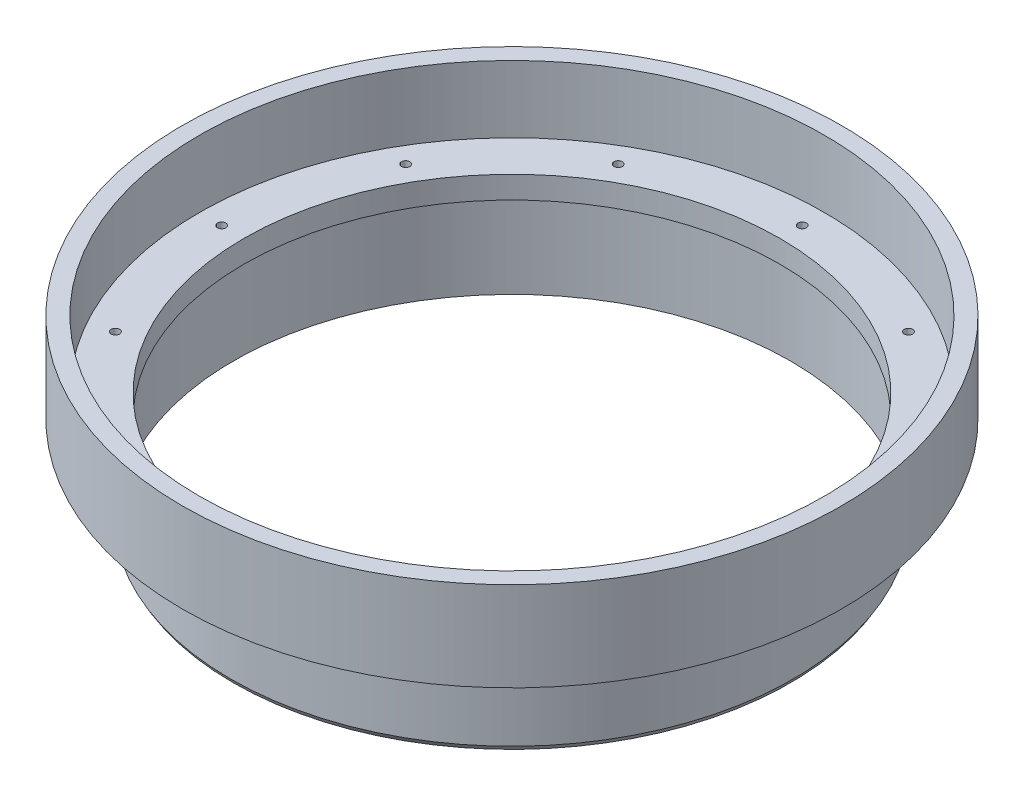
ISO-10303-21;
HEADER;
FILE_DESCRIPTION(('STEP AP214'),'2;1');
FILE_NAME('part.step','',(''),(''),'','','');
FILE_SCHEMA(('AUTOMOTIVE_DESIGN { 1 0 10303 214 1 1 1 1 }'));
ENDSEC;
DATA;
#1=APPLICATION_CONTEXT('core data for automotive mechanical design processes');
#2=APPLICATION_PROTOCOL_DEFINITION('international standard','automotive_design',2000,#1);
#3=PRODUCT_CONTEXT('',#1,'mechanical');
#4=PRODUCT('Part','Part','',(#3));
#5=PRODUCT_RELATED_PRODUCT_CATEGORY('part','',(#4));
#6=PRODUCT_DEFINITION_FORMATION('','',#4);
#7=PRODUCT_DEFINITION_CONTEXT('part definition',#1,'design');
#8=PRODUCT_DEFINITION('design','',#6,#7);
#9=PRODUCT_DEFINITION_SHAPE('','',#8);
#10=(LENGTH_UNIT() NAMED_UNIT(*) SI_UNIT(.MILLI.,.METRE.));
#11=(NAMED_UNIT(*) PLANE_ANGLE_UNIT() SI_UNIT($,.RADIAN.));
#12=(NAMED_UNIT(*) SI_UNIT($,.STERADIAN.) SOLID_ANGLE_UNIT());
#13=UNCERTAINTY_MEASURE_WITH_UNIT(LENGTH_MEASURE(1.E-05),#10,'distance_accuracy_value','');
#14=(GEOMETRIC_REPRESENTATION_CONTEXT(3) GLOBAL_UNCERTAINTY_ASSIGNED_CONTEXT((#13)) GLOBAL_UNIT_ASSIGNED_CONTEXT((#10,
#11,#12)) REPRESENTATION_CONTEXT('',''));
#15=CARTESIAN_POINT('',(0.,0.,0.));
#16=DIRECTION('',(0.,0.,1.));
#17=DIRECTION('',(1.,0.,0.));
#18=AXIS2_PLACEMENT_3D('',#15,#16,#17);
#19=CARTESIAN_POINT('',(-44.45,0.,0.));
#20=DIRECTION('',(0.,1.,0.));
#21=DIRECTION('',(0.,0.,1.));
#22=AXIS2_PLACEMENT_3D('',#19,#20,#21);
#23=PLANE('',#22);
#24=CARTESIAN_POINT('',(-35.7451985412029,0.,20.6374999999996));
#25=DIRECTION('',(0.,1.,0.));
#26=DIRECTION('',(0.,0.,1.));
#27=AXIS2_PLACEMENT_3D('',#24,#25,#26);
#28=CIRCLE('',#27,0.59563);
#29=CARTESIAN_POINT('',(-35.7451985412029,0.,21.2331299999996));
#30=VERTEX_POINT('',#29);
#31=EDGE_CURVE('E141',#30,#30,#28,.T.);
#32=ORIENTED_EDGE('',*,*,#31,.F.);
#33=EDGE_LOOP('',(#32));
#34=FACE_BOUND('',#33,.T.);
#35=CARTESIAN_POINT('',(-20.6375000000004,0.,35.7451985412025));
#36=DIRECTION('',(0.,1.,0.));
#37=DIRECTION('',(0.,0.,1.));
#38=AXIS2_PLACEMENT_3D('',#35,#36,#37);
#39=CIRCLE('',#38,0.59563);
#40=CARTESIAN_POINT('',(-20.6375000000004,0.,36.3408285412025));
#41=VERTEX_POINT('',#40);
#42=EDGE_CURVE('E135',#41,#41,#39,.T.);
#43=ORIENTED_EDGE('',*,*,#42,.F.);
#44=EDGE_LOOP('',(#43));
#45=FACE_BOUND('',#44,.T.);
#46=CARTESIAN_POINT('',(-3.53958818572525E-13,0.,41.275));
#47=DIRECTION('',(0.,1.,0.));
#48=DIRECTION('',(0.,0.,1.));
#49=AXIS2_PLACEMENT_3D('',#46,#47,#48);
#50=CIRCLE('',#49,0.595629999999999);
#51=CARTESIAN_POINT('',(-3.53958818572525E-13,0.,41.87063));
#52=VERTEX_POINT('',#51);
#53=EDGE_CURVE('E129',#52,#52,#50,.T.);
#54=ORIENTED_EDGE('',*,*,#53,.F.);
#55=EDGE_LOOP('',(#54));
#56=FACE_BOUND('',#55,.T.);
#57=CARTESIAN_POINT('',(20.6374999999997,0.,35.7451985412029));
#58=DIRECTION('',(0.,1.,0.));
#59=DIRECTION('',(0.,0.,1.));
#60=AXIS2_PLACEMENT_3D('',#57,#58,#59);
#61=CIRCLE('',#60,0.59563);
#62=CARTESIAN_POINT('',(20.6374999999997,0.,36.3408285412029));
#63=VERTEX_POINT('',#62);
#64=EDGE_CURVE('E123',#63,#63,#61,.T.);
#65=ORIENTED_EDGE('',*,*,#64,.F.);
#66=EDGE_LOOP('',(#65));
#67=FACE_BOUND('',#66,.T.);
#68=CARTESIAN_POINT('',(35.7451985412026,0.,20.6375000000002));
#69=DIRECTION('',(0.,1.,0.));
#70=DIRECTION('',(0.,0.,1.));
#71=AXIS2_PLACEMENT_3D('',#68,#69,#70);
#72=CIRCLE('',#71,0.59563);
#73=CARTESIAN_POINT('',(35.7451985412026,0.,21.2331300000002));
#74=VERTEX_POINT('',#73);
#75=EDGE_CURVE('E117',#74,#74,#72,.T.);
#76=ORIENTED_EDGE('',*,*,#75,.F.);
#77=EDGE_LOOP('',(#76));
#78=FACE_BOUND('',#77,.T.);
#79=CARTESIAN_POINT('',(41.275,0.,2.28177708448336E-13));
#80=DIRECTION('',(0.,1.,0.));
#81=DIRECTION('',(0.,0.,1.));
#82=AXIS2_PLACEMENT_3D('',#79,#80,#81);
#83=CIRCLE('',#82,0.59563);
#84=CARTESIAN_POINT('',(41.275,0.,0.595630000000228));
#85=VERTEX_POINT('',#84);
#86=EDGE_CURVE('E111',#85,#85,#83,.T.);
#87=ORIENTED_EDGE('',*,*,#86,.F.);
#88=EDGE_LOOP('',(#87));
#89=FACE_BOUND('',#88,.T.);
#90=CARTESIAN_POINT('',(35.7451985412028,0.,-20.6374999999998));
#91=DIRECTION('',(0.,1.,0.));
#92=DIRECTION('',(0.,0.,1.));
#93=AXIS2_PLACEMENT_3D('',#90,#91,#92);
#94=CIRCLE('',#93,0.59563);
#95=CARTESIAN_POINT('',(35.7451985412028,0.,-20.0418699999998));
#96=VERTEX_POINT('',#95);
#97=EDGE_CURVE('E105',#96,#96,#94,.T.);
#98=ORIENTED_EDGE('',*,*,#97,.F.);
#99=EDGE_LOOP('',(#98));
#100=FACE_BOUND('',#99,.T.);
#101=CARTESIAN_POINT('',(20.6375000000001,0.,-35.7451985412026));
#102=DIRECTION('',(0.,1.,0.));
#103=DIRECTION('',(0.,0.,1.));
#104=AXIS2_PLACEMENT_3D('',#101,#102,#103);
#105=CIRCLE('',#104,0.59563);
#106=CARTESIAN_POINT('',(20.6375000000001,0.,-35.1495685412026));
#107=VERTEX_POINT('',#106);
#108=EDGE_CURVE('E99',#107,#107,#105,.T.);
#109=ORIENTED_EDGE('',*,*,#108,.F.);
#110=EDGE_LOOP('',(#109));
#111=FACE_BOUND('',#110,.T.);
#112=CARTESIAN_POINT('',(1.11561489392428E-13,0.,-41.275));
#113=DIRECTION('',(0.,1.,0.));
#114=DIRECTION('',(0.,0.,1.));
#115=AXIS2_PLACEMENT_3D('',#112,#113,#114);
#116=CIRCLE('',#115,0.595629999999999);
#117=CARTESIAN_POINT('',(1.11561489392428E-13,0.,-40.67937));
#118=VERTEX_POINT('',#117);
#119=EDGE_CURVE('E93',#118,#118,#116,.T.);
#120=ORIENTED_EDGE('',*,*,#119,.F.);
#121=EDGE_LOOP('',(#120));
#122=FACE_BOUND('',#121,.T.);
#123=CARTESIAN_POINT('',(-20.6374999999999,0.,-35.7451985412027));
#124=DIRECTION('',(0.,1.,0.));
#125=DIRECTION('',(0.,0.,1.));
#126=AXIS2_PLACEMENT_3D('',#123,#124,#125);
#127=CIRCLE('',#126,0.59563);
#128=CARTESIAN_POINT('',(-20.6374999999999,0.,-35.1495685412027));
#129=VERTEX_POINT('',#128);
#130=EDGE_CURVE('E87',#129,#129,#127,.T.);
#131=ORIENTED_EDGE('',*,*,#130,.F.);
#132=EDGE_LOOP('',(#131));
#133=FACE_BOUND('',#132,.T.);
#134=CARTESIAN_POINT('',(-35.7451985412027,0.,-20.6375));
#135=DIRECTION('',(0.,1.,0.));
#136=DIRECTION('',(0.,0.,1.));
#137=AXIS2_PLACEMENT_3D('',#134,#135,#136);
#138=CIRCLE('',#137,0.59563);
#139=CARTESIAN_POINT('',(-35.7451985412027,0.,-20.04187));
#140=VERTEX_POINT('',#139);
#141=EDGE_CURVE('E81',#140,#140,#138,.T.);
#142=ORIENTED_EDGE('',*,*,#141,.F.);
#143=EDGE_LOOP('',(#142));
#144=FACE_BOUND('',#143,.T.);
#145=CARTESIAN_POINT('',(-41.275,0.,0.));
#146=DIRECTION('',(0.,1.,0.));
#147=DIRECTION('',(0.,0.,1.));
#148=AXIS2_PLACEMENT_3D('',#145,#146,#147);
#149=CIRCLE('',#148,0.59563);
#150=CARTESIAN_POINT('',(-41.275,0.,0.595630000000005));
#151=VERTEX_POINT('',#150);
#152=EDGE_CURVE('E75',#151,#151,#149,.T.);
#153=ORIENTED_EDGE('',*,*,#152,.F.);
#154=EDGE_LOOP('',(#153));
#155=FACE_BOUND('',#154,.T.);
#156=CARTESIAN_POINT('',(0.,0.,0.));
#157=DIRECTION('',(0.,1.,0.));
#158=DIRECTION('',(0.,0.,1.));
#159=AXIS2_PLACEMENT_3D('',#156,#157,#158);
#160=CIRCLE('',#159,44.45);
#161=CARTESIAN_POINT('',(0.,0.,44.45));
#162=VERTEX_POINT('',#161);
#163=EDGE_CURVE('E69',#162,#162,#160,.T.);
#164=ORIENTED_EDGE('',*,*,#163,.T.);
#165=EDGE_LOOP('',(#164));
#166=FACE_BOUND('',#165,.T.);
#167=CARTESIAN_POINT('',(0.,0.,0.));
#168=DIRECTION('',(0.,1.,0.));
#169=DIRECTION('',(0.,0.,1.));
#170=AXIS2_PLACEMENT_3D('',#167,#168,#169);
#171=CIRCLE('',#170,38.1);
#172=CARTESIAN_POINT('',(0.,0.,38.1));
#173=VERTEX_POINT('',#172);
#174=EDGE_CURVE('E10',#173,#173,#171,.T.);
#175=ORIENTED_EDGE('',*,*,#174,.F.);
#176=EDGE_LOOP('',(#175));
#177=FACE_BOUND('',#176,.T.);
#178=ADVANCED_FACE('F35',(#34,#45,#56,#67,#78,#89,#100,#111,#122,#133,#144,#155,#166,#177),#23,.T.);
#179=CARTESIAN_POINT('',(0.,55.,0.));
#180=DIRECTION('',(0.,1.,0.));
#181=DIRECTION('',(0.,0.,1.));
#182=AXIS2_PLACEMENT_3D('',#179,#180,#181);
#183=CYLINDRICAL_SURFACE('',#182,38.1);
#184=ORIENTED_EDGE('',*,*,#174,.T.);
#185=EDGE_LOOP('',(#184));
#186=FACE_BOUND('',#185,.T.);
#187=CARTESIAN_POINT('',(0.,-3.175,0.));
#188=DIRECTION('',(0.,1.,0.));
#189=DIRECTION('',(0.,0.,1.));
#190=AXIS2_PLACEMENT_3D('',#187,#188,#189);
#191=CIRCLE('',#190,38.1);
#192=CARTESIAN_POINT('',(0.,-3.175,38.1));
#193=VERTEX_POINT('',#192);
#194=EDGE_CURVE('E41',#193,#193,#191,.T.);
#195=ORIENTED_EDGE('',*,*,#194,.F.);
#196=EDGE_LOOP('',(#195));
#197=FACE_BOUND('',#196,.T.);
#198=ADVANCED_FACE('F149',(#186,#197),#183,.F.);
#199=CARTESIAN_POINT('',(-38.1,-3.175,0.));
#200=DIRECTION('',(0.,-1.,0.));
#201=DIRECTION('',(0.,0.,-1.));
#202=AXIS2_PLACEMENT_3D('',#199,#200,#201);
#203=PLANE('',#202);
#204=ORIENTED_EDGE('',*,*,#194,.T.);
#205=EDGE_LOOP('',(#204));
#206=FACE_BOUND('',#205,.T.);
#207=CARTESIAN_POINT('',(0.,-3.175,0.));
#208=DIRECTION('',(0.,1.,0.));
#209=DIRECTION('',(0.,0.,1.));
#210=AXIS2_PLACEMENT_3D('',#207,#208,#209);
#211=CIRCLE('',#210,39.624);
#212=CARTESIAN_POINT('',(0.,-3.175,39.624));
#213=VERTEX_POINT('',#212);
#214=EDGE_CURVE('E45',#213,#213,#211,.T.);
#215=ORIENTED_EDGE('',*,*,#214,.F.);
#216=EDGE_LOOP('',(#215));
#217=FACE_BOUND('',#216,.T.);
#218=ADVANCED_FACE('F211',(#206,#217),#203,.T.);
#219=CARTESIAN_POINT('',(0.,55.,0.));
#220=DIRECTION('',(0.,1.,0.));
#221=DIRECTION('',(0.,0.,1.));
#222=AXIS2_PLACEMENT_3D('',#219,#220,#221);
#223=CYLINDRICAL_SURFACE('',#222,39.624);
#224=ORIENTED_EDGE('',*,*,#214,.T.);
#225=EDGE_LOOP('',(#224));
#226=FACE_BOUND('',#225,.T.);
#227=CARTESIAN_POINT('',(0.,-15.875,0.));
#228=DIRECTION('',(0.,1.,0.));
#229=DIRECTION('',(0.,0.,1.));
#230=AXIS2_PLACEMENT_3D('',#227,#228,#229);
#231=CIRCLE('',#230,39.624);
#232=CARTESIAN_POINT('',(0.,-15.875,39.624));
#233=VERTEX_POINT('',#232);
#234=EDGE_CURVE('E49',#233,#233,#231,.T.);
#235=ORIENTED_EDGE('',*,*,#234,.F.);
#236=EDGE_LOOP('',(#235));
#237=FACE_BOUND('',#236,.T.);
#238=ADVANCED_FACE('F207',(#226,#237),#223,.F.);
#239=CARTESIAN_POINT('',(0.,-15.2150886423163,0.));
#240=DIRECTION('',(0.,1.,0.));
#241=DIRECTION('',(0.,0.,1.));
#242=AXIS2_PLACEMENT_3D('',#239,#240,#241);
#243=CONICAL_SURFACE('',#242,40.005,0.523598775598298);
#244=ORIENTED_EDGE('',*,*,#234,.T.);
#245=EDGE_LOOP('',(#244));
#246=FACE_BOUND('',#245,.T.);
#247=CARTESIAN_POINT('',(0.,-15.2150886423163,0.));
#248=DIRECTION('',(0.,1.,0.));
#249=DIRECTION('',(0.,0.,1.));
#250=AXIS2_PLACEMENT_3D('',#247,#248,#249);
#251=CIRCLE('',#250,40.005);
#252=CARTESIAN_POINT('',(0.,-15.2150886423163,40.005));
#253=VERTEX_POINT('',#252);
#254=EDGE_CURVE('E54',#253,#253,#251,.T.);
#255=ORIENTED_EDGE('',*,*,#254,.F.);
#256=EDGE_LOOP('',(#255));
#257=FACE_BOUND('',#256,.T.);
#258=ADVANCED_FACE('F203',(#246,#257),#243,.T.);
#259=CARTESIAN_POINT('',(0.,55.,0.));
#260=DIRECTION('',(0.,1.,0.));
#261=DIRECTION('',(0.,0.,1.));
#262=AXIS2_PLACEMENT_3D('',#259,#260,#261);
#263=CYLINDRICAL_SURFACE('',#262,40.005);
#264=ORIENTED_EDGE('',*,*,#254,.T.);
#265=EDGE_LOOP('',(#264));
#266=FACE_BOUND('',#265,.T.);
#267=CARTESIAN_POINT('',(0.,-3.175,0.));
#268=DIRECTION('',(0.,1.,0.));
#269=DIRECTION('',(0.,0.,1.));
#270=AXIS2_PLACEMENT_3D('',#267,#268,#269);
#271=CIRCLE('',#270,40.005);
#272=CARTESIAN_POINT('',(0.,-3.175,40.005));
#273=VERTEX_POINT('',#272);
#274=EDGE_CURVE('E57',#273,#273,#271,.T.);
#275=ORIENTED_EDGE('',*,*,#274,.F.);
#276=EDGE_LOOP('',(#275));
#277=FACE_BOUND('',#276,.T.);
#278=ADVANCED_FACE('F199',(#266,#277),#263,.T.);
#279=CARTESIAN_POINT('',(-40.005,-3.175,0.));
#280=DIRECTION('',(0.,-1.,0.));
#281=DIRECTION('',(0.,0.,-1.));
#282=AXIS2_PLACEMENT_3D('',#279,#280,#281);
#283=PLANE('',#282);
#284=CARTESIAN_POINT('',(-35.7451985412029,-3.175,20.6374999999996));
#285=DIRECTION('',(0.,1.,0.));
#286=DIRECTION('',(0.,0.,1.));
#287=AXIS2_PLACEMENT_3D('',#284,#285,#286);
#288=CIRCLE('',#287,0.59563);
#289=CARTESIAN_POINT('',(-35.7451985412029,-3.175,21.2331299999996));
#290=VERTEX_POINT('',#289);
#291=EDGE_CURVE('E138',#290,#290,#288,.T.);
#292=ORIENTED_EDGE('',*,*,#291,.T.);
#293=EDGE_LOOP('',(#292));
#294=FACE_BOUND('',#293,.T.);
#295=CARTESIAN_POINT('',(-20.6375000000004,-3.175,35.7451985412025));
#296=DIRECTION('',(0.,1.,0.));
#297=DIRECTION('',(0.,0.,1.));
#298=AXIS2_PLACEMENT_3D('',#295,#296,#297);
#299=CIRCLE('',#298,0.59563);
#300=CARTESIAN_POINT('',(-20.6375000000004,-3.175,36.3408285412025));
#301=VERTEX_POINT('',#300);
#302=EDGE_CURVE('E132',#301,#301,#299,.T.);
#303=ORIENTED_EDGE('',*,*,#302,.T.);
#304=EDGE_LOOP('',(#303));
#305=FACE_BOUND('',#304,.T.);
#306=CARTESIAN_POINT('',(-3.53958818572525E-13,-3.175,41.275));
#307=DIRECTION('',(0.,1.,0.));
#308=DIRECTION('',(0.,0.,1.));
#309=AXIS2_PLACEMENT_3D('',#306,#307,#308);
#310=CIRCLE('',#309,0.595629999999999);
#311=CARTESIAN_POINT('',(-3.53958818572525E-13,-3.175,41.87063));
#312=VERTEX_POINT('',#311);
#313=EDGE_CURVE('E126',#312,#312,#310,.T.);
#314=ORIENTED_EDGE('',*,*,#313,.T.);
#315=EDGE_LOOP('',(#314));
#316=FACE_BOUND('',#315,.T.);
#317=CARTESIAN_POINT('',(20.6374999999997,-3.175,35.7451985412029));
#318=DIRECTION('',(0.,1.,0.));
#319=DIRECTION('',(0.,0.,1.));
#320=AXIS2_PLACEMENT_3D('',#317,#318,#319);
#321=CIRCLE('',#320,0.59563);
#322=CARTESIAN_POINT('',(20.6374999999997,-3.175,36.3408285412029));
#323=VERTEX_POINT('',#322);
#324=EDGE_CURVE('E120',#323,#323,#321,.T.);
#325=ORIENTED_EDGE('',*,*,#324,.T.);
#326=EDGE_LOOP('',(#325));
#327=FACE_BOUND('',#326,.T.);
#328=CARTESIAN_POINT('',(35.7451985412026,-3.175,20.6375000000002));
#329=DIRECTION('',(0.,1.,0.));
#330=DIRECTION('',(0.,0.,1.));
#331=AXIS2_PLACEMENT_3D('',#328,#329,#330);
#332=CIRCLE('',#331,0.59563);
#333=CARTESIAN_POINT('',(35.7451985412026,-3.175,21.2331300000002));
#334=VERTEX_POINT('',#333);
#335=EDGE_CURVE('E114',#334,#334,#332,.T.);
#336=ORIENTED_EDGE('',*,*,#335,.T.);
#337=EDGE_LOOP('',(#336));
#338=FACE_BOUND('',#337,.T.);
#339=CARTESIAN_POINT('',(41.275,-3.175,2.28177708448336E-13));
#340=DIRECTION('',(0.,1.,0.));
#341=DIRECTION('',(0.,0.,1.));
#342=AXIS2_PLACEMENT_3D('',#339,#340,#341);
#343=CIRCLE('',#342,0.59563);
#344=CARTESIAN_POINT('',(41.275,-3.175,0.595630000000228));
#345=VERTEX_POINT('',#344);
#346=EDGE_CURVE('E108',#345,#345,#343,.T.);
#347=ORIENTED_EDGE('',*,*,#346,.T.);
#348=EDGE_LOOP('',(#347));
#349=FACE_BOUND('',#348,.T.);
#350=CARTESIAN_POINT('',(35.7451985412028,-3.175,-20.6374999999998));
#351=DIRECTION('',(0.,1.,0.));
#352=DIRECTION('',(0.,0.,1.));
#353=AXIS2_PLACEMENT_3D('',#350,#351,#352);
#354=CIRCLE('',#353,0.59563);
#355=CARTESIAN_POINT('',(35.7451985412028,-3.175,-20.0418699999998));
#356=VERTEX_POINT('',#355);
#357=EDGE_CURVE('E102',#356,#356,#354,.T.);
#358=ORIENTED_EDGE('',*,*,#357,.T.);
#359=EDGE_LOOP('',(#358));
#360=FACE_BOUND('',#359,.T.);
#361=CARTESIAN_POINT('',(20.6375000000001,-3.175,-35.7451985412026));
#362=DIRECTION('',(0.,1.,0.));
#363=DIRECTION('',(0.,0.,1.));
#364=AXIS2_PLACEMENT_3D('',#361,#362,#363);
#365=CIRCLE('',#364,0.59563);
#366=CARTESIAN_POINT('',(20.6375000000001,-3.175,-35.1495685412026));
#367=VERTEX_POINT('',#366);
#368=EDGE_CURVE('E96',#367,#367,#365,.T.);
#369=ORIENTED_EDGE('',*,*,#368,.T.);
#370=EDGE_LOOP('',(#369));
#371=FACE_BOUND('',#370,.T.);
#372=CARTESIAN_POINT('',(1.11561489392428E-13,-3.175,-41.275));
#373=DIRECTION('',(0.,1.,0.));
#374=DIRECTION('',(0.,0.,1.));
#375=AXIS2_PLACEMENT_3D('',#372,#373,#374);
#376=CIRCLE('',#375,0.595629999999999);
#377=CARTESIAN_POINT('',(1.11561489392428E-13,-3.175,-40.67937));
#378=VERTEX_POINT('',#377);
#379=EDGE_CURVE('E90',#378,#378,#376,.T.);
#380=ORIENTED_EDGE('',*,*,#379,.T.);
#381=EDGE_LOOP('',(#380));
#382=FACE_BOUND('',#381,.T.);
#383=CARTESIAN_POINT('',(-20.6374999999999,-3.175,-35.7451985412027));
#384=DIRECTION('',(0.,1.,0.));
#385=DIRECTION('',(0.,0.,1.));
#386=AXIS2_PLACEMENT_3D('',#383,#384,#385);
#387=CIRCLE('',#386,0.59563);
#388=CARTESIAN_POINT('',(-20.6374999999999,-3.175,-35.1495685412027));
#389=VERTEX_POINT('',#388);
#390=EDGE_CURVE('E84',#389,#389,#387,.T.);
#391=ORIENTED_EDGE('',*,*,#390,.T.);
#392=EDGE_LOOP('',(#391));
#393=FACE_BOUND('',#392,.T.);
#394=CARTESIAN_POINT('',(-35.7451985412027,-3.175,-20.6375));
#395=DIRECTION('',(0.,1.,0.));
#396=DIRECTION('',(0.,0.,1.));
#397=AXIS2_PLACEMENT_3D('',#394,#395,#396);
#398=CIRCLE('',#397,0.59563);
#399=CARTESIAN_POINT('',(-35.7451985412027,-3.175,-20.04187));
#400=VERTEX_POINT('',#399);
#401=EDGE_CURVE('E78',#400,#400,#398,.T.);
#402=ORIENTED_EDGE('',*,*,#401,.T.);
#403=EDGE_LOOP('',(#402));
#404=FACE_BOUND('',#403,.T.);
#405=CARTESIAN_POINT('',(-41.275,-3.175,0.));
#406=DIRECTION('',(0.,1.,0.));
#407=DIRECTION('',(0.,0.,1.));
#408=AXIS2_PLACEMENT_3D('',#405,#406,#407);
#409=CIRCLE('',#408,0.59563);
#410=CARTESIAN_POINT('',(-41.275,-3.175,0.595630000000005));
#411=VERTEX_POINT('',#410);
#412=EDGE_CURVE('E72',#411,#411,#409,.T.);
#413=ORIENTED_EDGE('',*,*,#412,.T.);
#414=EDGE_LOOP('',(#413));
#415=FACE_BOUND('',#414,.T.);
#416=ORIENTED_EDGE('',*,*,#274,.T.);
#417=EDGE_LOOP('',(#416));
#418=FACE_BOUND('',#417,.T.);
#419=CARTESIAN_POINT('',(0.,-3.175,0.));
#420=DIRECTION('',(0.,1.,0.));
#421=DIRECTION('',(0.,0.,1.));
#422=AXIS2_PLACEMENT_3D('',#419,#420,#421);
#423=CIRCLE('',#422,46.863);
#424=CARTESIAN_POINT('',(0.,-3.175,46.863));
#425=VERTEX_POINT('',#424);
#426=EDGE_CURVE('E60',#425,#425,#423,.T.);
#427=ORIENTED_EDGE('',*,*,#426,.F.);
#428=EDGE_LOOP('',(#427));
#429=FACE_BOUND('',#428,.T.);
#430=ADVANCED_FACE('F195',(#294,#305,#316,#327,#338,#349,#360,#371,#382,#393,#404,#415,#418,
#429),#283,.T.);
#431=CARTESIAN_POINT('',(0.,55.,0.));
#432=DIRECTION('',(0.,1.,0.));
#433=DIRECTION('',(0.,0.,1.));
#434=AXIS2_PLACEMENT_3D('',#431,#432,#433);
#435=CYLINDRICAL_SURFACE('',#434,46.863);
#436=ORIENTED_EDGE('',*,*,#426,.T.);
#437=EDGE_LOOP('',(#436));
#438=FACE_BOUND('',#437,.T.);
#439=CARTESIAN_POINT('',(0.,9.525,0.));
#440=DIRECTION('',(0.,1.,0.));
#441=DIRECTION('',(0.,0.,1.));
#442=AXIS2_PLACEMENT_3D('',#439,#440,#441);
#443=CIRCLE('',#442,46.863);
#444=CARTESIAN_POINT('',(0.,9.525,46.863));
#445=VERTEX_POINT('',#444);
#446=EDGE_CURVE('E63',#445,#445,#443,.T.);
#447=ORIENTED_EDGE('',*,*,#446,.F.);
#448=EDGE_LOOP('',(#447));
#449=FACE_BOUND('',#448,.T.);
#450=ADVANCED_FACE('F188',(#438,#449),#435,.T.);
#451=CARTESIAN_POINT('',(-46.863,9.525,0.));
#452=DIRECTION('',(0.,1.,0.));
#453=DIRECTION('',(0.,0.,1.));
#454=AXIS2_PLACEMENT_3D('',#451,#452,#453);
#455=PLANE('',#454);
#456=ORIENTED_EDGE('',*,*,#446,.T.);
#457=EDGE_LOOP('',(#456));
#458=FACE_BOUND('',#457,.T.);
#459=CARTESIAN_POINT('',(0.,9.525,0.));
#460=DIRECTION('',(0.,1.,0.));
#461=DIRECTION('',(0.,0.,1.));
#462=AXIS2_PLACEMENT_3D('',#459,#460,#461);
#463=CIRCLE('',#462,44.45);
#464=CARTESIAN_POINT('',(0.,9.525,44.45));
#465=VERTEX_POINT('',#464);
#466=EDGE_CURVE('E66',#465,#465,#463,.T.);
#467=ORIENTED_EDGE('',*,*,#466,.F.);
#468=EDGE_LOOP('',(#467));
#469=FACE_BOUND('',#468,.T.);
#470=ADVANCED_FACE('F178',(#458,#469),#455,.T.);
#471=CARTESIAN_POINT('',(0.,55.,0.));
#472=DIRECTION('',(0.,1.,0.));
#473=DIRECTION('',(0.,0.,1.));
#474=AXIS2_PLACEMENT_3D('',#471,#472,#473);
#475=CYLINDRICAL_SURFACE('',#474,44.45);
#476=ORIENTED_EDGE('',*,*,#466,.T.);
#477=EDGE_LOOP('',(#476));
#478=FACE_BOUND('',#477,.T.);
#479=ORIENTED_EDGE('',*,*,#163,.F.);
#480=EDGE_LOOP('',(#479));
#481=FACE_BOUND('',#480,.T.);
#482=ADVANCED_FACE('F175',(#478,#481),#475,.F.);
#483=CARTESIAN_POINT('',(-41.275,0.,0.));
#484=DIRECTION('',(0.,1.,0.));
#485=DIRECTION('',(0.,0.,1.));
#486=AXIS2_PLACEMENT_3D('',#483,#484,#485);
#487=CYLINDRICAL_SURFACE('',#486,0.59563);
#488=ORIENTED_EDGE('',*,*,#412,.F.);
#489=EDGE_LOOP('',(#488));
#490=FACE_BOUND('',#489,.T.);
#491=ORIENTED_EDGE('',*,*,#152,.T.);
#492=EDGE_LOOP('',(#491));
#493=FACE_BOUND('',#492,.T.);
#494=ADVANCED_FACE('F177',(#490,#493),#487,.F.);
#495=CARTESIAN_POINT('',(-35.7451985412027,0.,-20.6375));
#496=DIRECTION('',(0.,1.,0.));
#497=DIRECTION('',(0.,0.,1.));
#498=AXIS2_PLACEMENT_3D('',#495,#496,#497);
#499=CYLINDRICAL_SURFACE('',#498,0.59563);
#500=ORIENTED_EDGE('',*,*,#401,.F.);
#501=EDGE_LOOP('',(#500));
#502=FACE_BOUND('',#501,.T.);
#503=ORIENTED_EDGE('',*,*,#141,.T.);
#504=EDGE_LOOP('',(#503));
#505=FACE_BOUND('',#504,.T.);
#506=ADVANCED_FACE('F185',(#502,#505),#499,.F.);
#507=CARTESIAN_POINT('',(-20.6374999999999,0.,-35.7451985412027));
#508=DIRECTION('',(0.,1.,0.));
#509=DIRECTION('',(0.,0.,1.));
#510=AXIS2_PLACEMENT_3D('',#507,#508,#509);
#511=CYLINDRICAL_SURFACE('',#510,0.59563);
#512=ORIENTED_EDGE('',*,*,#390,.F.);
#513=EDGE_LOOP('',(#512));
#514=FACE_BOUND('',#513,.T.);
#515=ORIENTED_EDGE('',*,*,#130,.T.);
#516=EDGE_LOOP('',(#515));
#517=FACE_BOUND('',#516,.T.);
#518=ADVANCED_FACE('F335',(#514,#517),#511,.F.);
#519=CARTESIAN_POINT('',(1.11561489392428E-13,0.,-41.275));
#520=DIRECTION('',(0.,1.,0.));
#521=DIRECTION('',(0.,0.,1.));
#522=AXIS2_PLACEMENT_3D('',#519,#520,#521);
#523=CYLINDRICAL_SURFACE('',#522,0.595629999999999);
#524=ORIENTED_EDGE('',*,*,#379,.F.);
#525=EDGE_LOOP('',(#524));
#526=FACE_BOUND('',#525,.T.);
#527=ORIENTED_EDGE('',*,*,#119,.T.);
#528=EDGE_LOOP('',(#527));
#529=FACE_BOUND('',#528,.T.);
#530=ADVANCED_FACE('F330',(#526,#529),#523,.F.);
#531=CARTESIAN_POINT('',(20.6375000000001,0.,-35.7451985412026));
#532=DIRECTION('',(0.,1.,0.));
#533=DIRECTION('',(0.,0.,1.));
#534=AXIS2_PLACEMENT_3D('',#531,#532,#533);
#535=CYLINDRICAL_SURFACE('',#534,0.59563);
#536=ORIENTED_EDGE('',*,*,#368,.F.);
#537=EDGE_LOOP('',(#536));
#538=FACE_BOUND('',#537,.T.);
#539=ORIENTED_EDGE('',*,*,#108,.T.);
#540=EDGE_LOOP('',(#539));
#541=FACE_BOUND('',#540,.T.);
#542=ADVANCED_FACE('F308',(#538,#541),#535,.F.);
#543=CARTESIAN_POINT('',(35.7451985412028,0.,-20.6374999999998));
#544=DIRECTION('',(0.,1.,0.));
#545=DIRECTION('',(0.,0.,1.));
#546=AXIS2_PLACEMENT_3D('',#543,#544,#545);
#547=CYLINDRICAL_SURFACE('',#546,0.59563);
#548=ORIENTED_EDGE('',*,*,#357,.F.);
#549=EDGE_LOOP('',(#548));
#550=FACE_BOUND('',#549,.T.);
#551=ORIENTED_EDGE('',*,*,#97,.T.);
#552=EDGE_LOOP('',(#551));
#553=FACE_BOUND('',#552,.T.);
#554=ADVANCED_FACE('F302',(#550,#553),#547,.F.);
#555=CARTESIAN_POINT('',(41.275,0.,2.28177708448336E-13));
#556=DIRECTION('',(0.,1.,0.));
#557=DIRECTION('',(0.,0.,1.));
#558=AXIS2_PLACEMENT_3D('',#555,#556,#557);
#559=CYLINDRICAL_SURFACE('',#558,0.59563);
#560=ORIENTED_EDGE('',*,*,#346,.F.);
#561=EDGE_LOOP('',(#560));
#562=FACE_BOUND('',#561,.T.);
#563=ORIENTED_EDGE('',*,*,#86,.T.);
#564=EDGE_LOOP('',(#563));
#565=FACE_BOUND('',#564,.T.);
#566=ADVANCED_FACE('F307',(#562,#565),#559,.F.);
#567=CARTESIAN_POINT('',(35.7451985412026,0.,20.6375000000002));
#568=DIRECTION('',(0.,1.,0.));
#569=DIRECTION('',(0.,0.,1.));
#570=AXIS2_PLACEMENT_3D('',#567,#568,#569);
#571=CYLINDRICAL_SURFACE('',#570,0.59563);
#572=ORIENTED_EDGE('',*,*,#335,.F.);
#573=EDGE_LOOP('',(#572));
#574=FACE_BOUND('',#573,.T.);
#575=ORIENTED_EDGE('',*,*,#75,.T.);
#576=EDGE_LOOP('',(#575));
#577=FACE_BOUND('',#576,.T.);
#578=ADVANCED_FACE('F292',(#574,#577),#571,.F.);
#579=CARTESIAN_POINT('',(20.6374999999997,0.,35.7451985412029));
#580=DIRECTION('',(0.,1.,0.));
#581=DIRECTION('',(0.,0.,1.));
#582=AXIS2_PLACEMENT_3D('',#579,#580,#581);
#583=CYLINDRICAL_SURFACE('',#582,0.59563);
#584=ORIENTED_EDGE('',*,*,#324,.F.);
#585=EDGE_LOOP('',(#584));
#586=FACE_BOUND('',#585,.T.);
#587=ORIENTED_EDGE('',*,*,#64,.T.);
#588=EDGE_LOOP('',(#587));
#589=FACE_BOUND('',#588,.T.);
#590=ADVANCED_FACE('F286',(#586,#589),#583,.F.);
#591=CARTESIAN_POINT('',(-3.53958818572525E-13,0.,41.275));
#592=DIRECTION('',(0.,1.,0.));
#593=DIRECTION('',(0.,0.,1.));
#594=AXIS2_PLACEMENT_3D('',#591,#592,#593);
#595=CYLINDRICAL_SURFACE('',#594,0.595629999999999);
#596=ORIENTED_EDGE('',*,*,#313,.F.);
#597=EDGE_LOOP('',(#596));
#598=FACE_BOUND('',#597,.T.);
#599=ORIENTED_EDGE('',*,*,#53,.T.);
#600=EDGE_LOOP('',(#599));
#601=FACE_BOUND('',#600,.T.);
#602=ADVANCED_FACE('F291',(#598,#601),#595,.F.);
#603=CARTESIAN_POINT('',(-20.6375000000004,0.,35.7451985412025));
#604=DIRECTION('',(0.,1.,0.));
#605=DIRECTION('',(0.,0.,1.));
#606=AXIS2_PLACEMENT_3D('',#603,#604,#605);
#607=CYLINDRICAL_SURFACE('',#606,0.59563);
#608=ORIENTED_EDGE('',*,*,#302,.F.);
#609=EDGE_LOOP('',(#608));
#610=FACE_BOUND('',#609,.T.);
#611=ORIENTED_EDGE('',*,*,#42,.T.);
#612=EDGE_LOOP('',(#611));
#613=FACE_BOUND('',#612,.T.);
#614=ADVANCED_FACE('F322',(#610,#613),#607,.F.);
#615=CARTESIAN_POINT('',(-35.7451985412029,0.,20.6374999999996));
#616=DIRECTION('',(0.,1.,0.));
#617=DIRECTION('',(0.,0.,1.));
#618=AXIS2_PLACEMENT_3D('',#615,#616,#617);
#619=CYLINDRICAL_SURFACE('',#618,0.59563);
#620=ORIENTED_EDGE('',*,*,#291,.F.);
#621=EDGE_LOOP('',(#620));
#622=FACE_BOUND('',#621,.T.);
#623=ORIENTED_EDGE('',*,*,#31,.T.);
#624=EDGE_LOOP('',(#623));
#625=FACE_BOUND('',#624,.T.);
#626=ADVANCED_FACE('F145',(#622,#625),#619,.F.);
#627=CLOSED_SHELL('',(#178,#198,#218,#238,#258,#278,#430,#450,#470,#482,#494,#506,#518,#530,
#542,#554,#566,#578,#590,#602,#614,#626));
#628=MANIFOLD_SOLID_BREP('B2',#627);
#629=ADVANCED_BREP_SHAPE_REPRESENTATION('',(#18,#628),#14);
#630=SHAPE_DEFINITION_REPRESENTATION(#9,#629);
ENDSEC;
END-ISO-10303-21;
